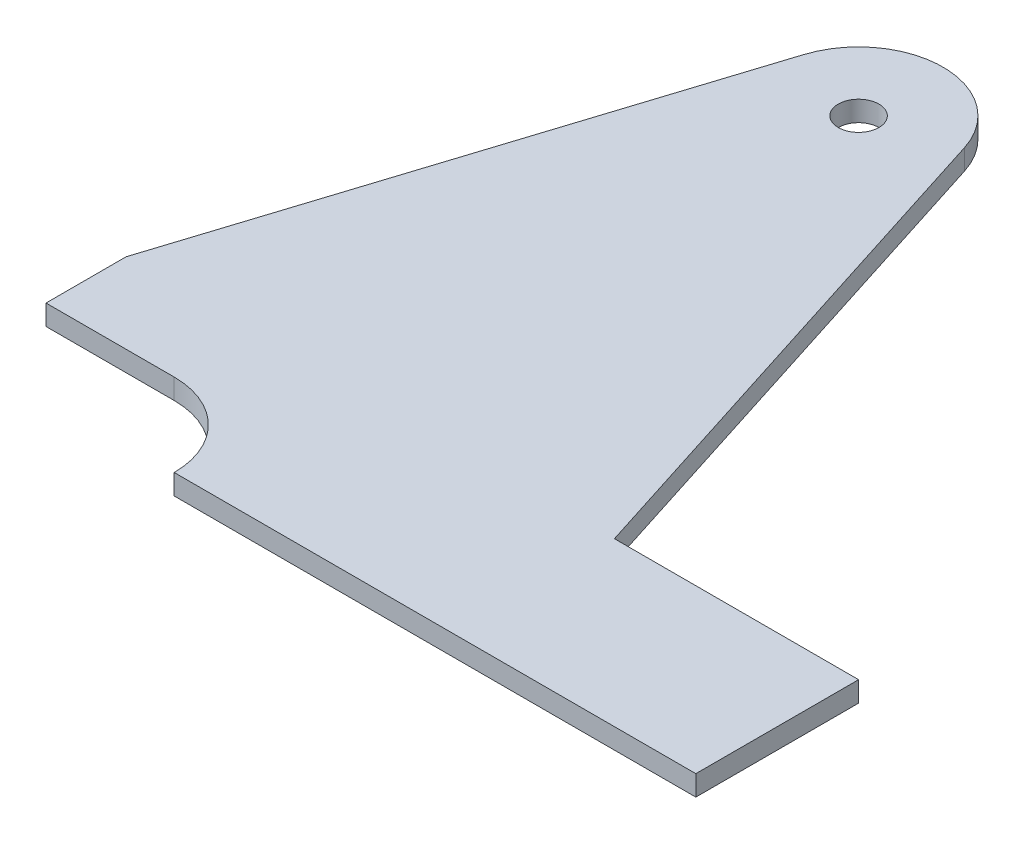
ISO-10303-21;
HEADER;
FILE_DESCRIPTION(('STEP AP214'),'2;1');
FILE_NAME('part.step','',(''),(''),'','','');
FILE_SCHEMA(('AUTOMOTIVE_DESIGN { 1 0 10303 214 1 1 1 1 }'));
ENDSEC;
DATA;
#1=APPLICATION_CONTEXT('core data for automotive mechanical design processes');
#2=APPLICATION_PROTOCOL_DEFINITION('international standard','automotive_design',2000,#1);
#3=PRODUCT_CONTEXT('',#1,'mechanical');
#4=PRODUCT('Part','Part','',(#3));
#5=PRODUCT_RELATED_PRODUCT_CATEGORY('part','',(#4));
#6=PRODUCT_DEFINITION_FORMATION('','',#4);
#7=PRODUCT_DEFINITION_CONTEXT('part definition',#1,'design');
#8=PRODUCT_DEFINITION('design','',#6,#7);
#9=PRODUCT_DEFINITION_SHAPE('','',#8);
#10=(LENGTH_UNIT() NAMED_UNIT(*) SI_UNIT(.MILLI.,.METRE.));
#11=(NAMED_UNIT(*) PLANE_ANGLE_UNIT() SI_UNIT($,.RADIAN.));
#12=(NAMED_UNIT(*) SI_UNIT($,.STERADIAN.) SOLID_ANGLE_UNIT());
#13=UNCERTAINTY_MEASURE_WITH_UNIT(LENGTH_MEASURE(1.E-05),#10,'distance_accuracy_value','');
#14=(GEOMETRIC_REPRESENTATION_CONTEXT(3) GLOBAL_UNCERTAINTY_ASSIGNED_CONTEXT((#13)) GLOBAL_UNIT_ASSIGNED_CONTEXT((#10,
#11,#12)) REPRESENTATION_CONTEXT('',''));
#15=CARTESIAN_POINT('',(0.,0.,0.));
#16=DIRECTION('',(0.,0.,1.));
#17=DIRECTION('',(1.,0.,0.));
#18=AXIS2_PLACEMENT_3D('',#15,#16,#17);
#19=CARTESIAN_POINT('',(-36.2,6.35,203.2));
#20=DIRECTION('',(0.,1.,0.));
#21=DIRECTION('',(0.,0.,1.));
#22=AXIS2_PLACEMENT_3D('',#19,#20,#21);
#23=PLANE('',#22);
#24=DIRECTION('',(0.,0.,1.));
#25=VECTOR('',#24,1.);
#26=CARTESIAN_POINT('',(-76.2,6.35,152.4));
#27=LINE('',#26,#25);
#28=CARTESIAN_POINT('',(-76.2,6.35,152.4));
#29=VERTEX_POINT('',#28);
#30=CARTESIAN_POINT('',(-76.2,6.35,177.4));
#31=VERTEX_POINT('',#30);
#32=EDGE_CURVE('E163',#29,#31,#27,.T.);
#33=ORIENTED_EDGE('',*,*,#32,.T.);
#34=DIRECTION('',(1.,0.,0.));
#35=VECTOR('',#34,1.);
#36=CARTESIAN_POINT('',(-76.2,6.35,177.4));
#37=LINE('',#36,#35);
#38=CARTESIAN_POINT('',(-36.2,6.35,177.4));
#39=VERTEX_POINT('',#38);
#40=EDGE_CURVE('E106',#31,#39,#37,.T.);
#41=ORIENTED_EDGE('',*,*,#40,.T.);
#42=CARTESIAN_POINT('',(-36.2,6.35,203.2));
#43=DIRECTION('',(0.,-1.,0.));
#44=DIRECTION('',(0.,0.,1.));
#45=AXIS2_PLACEMENT_3D('',#42,#43,#44);
#46=CIRCLE('',#45,25.8);
#47=CARTESIAN_POINT('',(-10.3999999999999,6.35,203.2));
#48=VERTEX_POINT('',#47);
#49=EDGE_CURVE('E181',#39,#48,#46,.T.);
#50=ORIENTED_EDGE('',*,*,#49,.T.);
#51=DIRECTION('',(1.,0.,0.));
#52=VECTOR('',#51,1.);
#53=CARTESIAN_POINT('',(152.4,6.35,203.2));
#54=LINE('',#53,#52);
#55=CARTESIAN_POINT('',(152.4,6.35,203.2));
#56=VERTEX_POINT('',#55);
#57=EDGE_CURVE('E198',#48,#56,#54,.T.);
#58=ORIENTED_EDGE('',*,*,#57,.T.);
#59=DIRECTION('',(0.,0.,-1.));
#60=VECTOR('',#59,1.);
#61=CARTESIAN_POINT('',(152.4,6.35,152.4));
#62=LINE('',#61,#60);
#63=CARTESIAN_POINT('',(152.4,6.35,152.4));
#64=VERTEX_POINT('',#63);
#65=EDGE_CURVE('E197',#56,#64,#62,.T.);
#66=ORIENTED_EDGE('',*,*,#65,.T.);
#67=DIRECTION('',(-1.,0.,0.));
#68=VECTOR('',#67,1.);
#69=CARTESIAN_POINT('',(76.2,6.35,152.4));
#70=LINE('',#69,#68);
#71=CARTESIAN_POINT('',(76.2,6.35,152.4));
#72=VERTEX_POINT('',#71);
#73=EDGE_CURVE('E128',#64,#72,#70,.T.);
#74=ORIENTED_EDGE('',*,*,#73,.T.);
#75=DIRECTION('',(-0.303513333205354,0.,-0.952827191345091));
#76=VECTOR('',#75,1.);
#77=CARTESIAN_POINT('',(76.2,6.35,152.4));
#78=LINE('',#77,#76);
#79=CARTESIAN_POINT('',(25.1069964919431,6.35,-7.99757632996109));
#80=VERTEX_POINT('',#79);
#81=EDGE_CURVE('E122',#72,#80,#78,.T.);
#82=ORIENTED_EDGE('',*,*,#81,.T.);
#83=CARTESIAN_POINT('',(0.,6.35,0.));
#84=DIRECTION('',(0.,1.,0.));
#85=DIRECTION('',(0.,0.,-1.));
#86=AXIS2_PLACEMENT_3D('',#83,#84,#85);
#87=CIRCLE('',#86,26.35);
#88=CARTESIAN_POINT('',(-25.1069964919431,6.35,-7.99757632996108));
#89=VERTEX_POINT('',#88);
#90=EDGE_CURVE('E126',#80,#89,#87,.T.);
#91=ORIENTED_EDGE('',*,*,#90,.T.);
#92=DIRECTION('',(-0.303513333205354,0.,0.952827191345091));
#93=VECTOR('',#92,1.);
#94=CARTESIAN_POINT('',(-76.2,6.35,152.4));
#95=LINE('',#94,#93);
#96=EDGE_CURVE('E60',#89,#29,#95,.T.);
#97=ORIENTED_EDGE('',*,*,#96,.T.);
#98=EDGE_LOOP('',(#33,#41,#50,#58,#66,#74,#82,#91,#97));
#99=FACE_BOUND('',#98,.T.);
#100=CARTESIAN_POINT('',(0.,6.35,0.));
#101=DIRECTION('',(0.,1.,0.));
#102=DIRECTION('',(0.,0.,1.));
#103=AXIS2_PLACEMENT_3D('',#100,#101,#102);
#104=CIRCLE('',#103,6.35);
#105=CARTESIAN_POINT('',(0.,6.35,6.35));
#106=VERTEX_POINT('',#105);
#107=EDGE_CURVE('E150',#106,#106,#104,.T.);
#108=ORIENTED_EDGE('',*,*,#107,.F.);
#109=EDGE_LOOP('',(#108));
#110=FACE_BOUND('',#109,.T.);
#111=ADVANCED_FACE('F43',(#99,#110),#23,.T.);
#112=CARTESIAN_POINT('',(-36.2,0.,203.2));
#113=DIRECTION('',(0.,1.,0.));
#114=DIRECTION('',(0.,0.,1.));
#115=AXIS2_PLACEMENT_3D('',#112,#113,#114);
#116=PLANE('',#115);
#117=DIRECTION('',(0.,0.,1.));
#118=VECTOR('',#117,1.);
#119=CARTESIAN_POINT('',(-76.2,0.,152.4));
#120=LINE('',#119,#118);
#121=CARTESIAN_POINT('',(-76.2,0.,152.4));
#122=VERTEX_POINT('',#121);
#123=CARTESIAN_POINT('',(-76.2,0.,177.4));
#124=VERTEX_POINT('',#123);
#125=EDGE_CURVE('E146',#122,#124,#120,.T.);
#126=ORIENTED_EDGE('',*,*,#125,.F.);
#127=DIRECTION('',(-0.303513333205354,0.,0.952827191345091));
#128=VECTOR('',#127,1.);
#129=CARTESIAN_POINT('',(-76.2,0.,152.4));
#130=LINE('',#129,#128);
#131=CARTESIAN_POINT('',(-25.1069964919431,0.,-7.99757632996108));
#132=VERTEX_POINT('',#131);
#133=EDGE_CURVE('E98',#132,#122,#130,.T.);
#134=ORIENTED_EDGE('',*,*,#133,.F.);
#135=CARTESIAN_POINT('',(0.,0.,0.));
#136=DIRECTION('',(0.,1.,0.));
#137=DIRECTION('',(0.,0.,-1.));
#138=AXIS2_PLACEMENT_3D('',#135,#136,#137);
#139=CIRCLE('',#138,26.35);
#140=CARTESIAN_POINT('',(25.1069964919431,0.,-7.99757632996109));
#141=VERTEX_POINT('',#140);
#142=EDGE_CURVE('E92',#141,#132,#139,.T.);
#143=ORIENTED_EDGE('',*,*,#142,.F.);
#144=DIRECTION('',(-0.303513333205354,0.,-0.952827191345091));
#145=VECTOR('',#144,1.);
#146=CARTESIAN_POINT('',(76.2,0.,152.4));
#147=LINE('',#146,#145);
#148=CARTESIAN_POINT('',(76.2,0.,152.4));
#149=VERTEX_POINT('',#148);
#150=EDGE_CURVE('E136',#149,#141,#147,.T.);
#151=ORIENTED_EDGE('',*,*,#150,.F.);
#152=DIRECTION('',(-1.,0.,0.));
#153=VECTOR('',#152,1.);
#154=CARTESIAN_POINT('',(76.2,0.,152.4));
#155=LINE('',#154,#153);
#156=CARTESIAN_POINT('',(152.4,0.,152.4));
#157=VERTEX_POINT('',#156);
#158=EDGE_CURVE('E158',#157,#149,#155,.T.);
#159=ORIENTED_EDGE('',*,*,#158,.F.);
#160=DIRECTION('',(0.,0.,-1.));
#161=VECTOR('',#160,1.);
#162=CARTESIAN_POINT('',(152.4,0.,152.4));
#163=LINE('',#162,#161);
#164=CARTESIAN_POINT('',(152.4,0.,203.2));
#165=VERTEX_POINT('',#164);
#166=EDGE_CURVE('E156',#165,#157,#163,.T.);
#167=ORIENTED_EDGE('',*,*,#166,.F.);
#168=DIRECTION('',(1.,0.,0.));
#169=VECTOR('',#168,1.);
#170=CARTESIAN_POINT('',(152.4,0.,203.2));
#171=LINE('',#170,#169);
#172=CARTESIAN_POINT('',(-10.3999999999999,0.,203.2));
#173=VERTEX_POINT('',#172);
#174=EDGE_CURVE('E154',#173,#165,#171,.T.);
#175=ORIENTED_EDGE('',*,*,#174,.F.);
#176=CARTESIAN_POINT('',(-36.2,0.,203.2));
#177=DIRECTION('',(0.,-1.,0.));
#178=DIRECTION('',(0.,0.,1.));
#179=AXIS2_PLACEMENT_3D('',#176,#177,#178);
#180=CIRCLE('',#179,25.8);
#181=CARTESIAN_POINT('',(-36.2,0.,177.4));
#182=VERTEX_POINT('',#181);
#183=EDGE_CURVE('E152',#182,#173,#180,.T.);
#184=ORIENTED_EDGE('',*,*,#183,.F.);
#185=DIRECTION('',(1.,0.,0.));
#186=VECTOR('',#185,1.);
#187=CARTESIAN_POINT('',(-76.2,0.,177.4));
#188=LINE('',#187,#186);
#189=EDGE_CURVE('E149',#124,#182,#188,.T.);
#190=ORIENTED_EDGE('',*,*,#189,.F.);
#191=EDGE_LOOP('',(#126,#134,#143,#151,#159,#167,#175,#184,#190));
#192=FACE_BOUND('',#191,.T.);
#193=CARTESIAN_POINT('',(0.,0.,0.));
#194=DIRECTION('',(0.,1.,0.));
#195=DIRECTION('',(0.,0.,1.));
#196=AXIS2_PLACEMENT_3D('',#193,#194,#195);
#197=CIRCLE('',#196,6.35);
#198=CARTESIAN_POINT('',(0.,0.,6.35));
#199=VERTEX_POINT('',#198);
#200=EDGE_CURVE('E205',#199,#199,#197,.T.);
#201=ORIENTED_EDGE('',*,*,#200,.T.);
#202=EDGE_LOOP('',(#201));
#203=FACE_BOUND('',#202,.T.);
#204=ADVANCED_FACE('F185',(#192,#203),#116,.F.);
#205=CARTESIAN_POINT('',(-76.2,6.35,152.4));
#206=DIRECTION('',(1.,0.,0.));
#207=DIRECTION('',(0.,0.,-1.));
#208=AXIS2_PLACEMENT_3D('',#205,#206,#207);
#209=PLANE('',#208);
#210=ORIENTED_EDGE('',*,*,#125,.T.);
#211=DIRECTION('',(0.,-1.,0.));
#212=VECTOR('',#211,1.);
#213=CARTESIAN_POINT('',(-76.2,6.35,177.4));
#214=LINE('',#213,#212);
#215=EDGE_CURVE('E11',#31,#124,#214,.T.);
#216=ORIENTED_EDGE('',*,*,#215,.F.);
#217=ORIENTED_EDGE('',*,*,#32,.F.);
#218=DIRECTION('',(0.,-1.,0.));
#219=VECTOR('',#218,1.);
#220=CARTESIAN_POINT('',(-76.2,6.35,152.4));
#221=LINE('',#220,#219);
#222=EDGE_CURVE('E142',#29,#122,#221,.T.);
#223=ORIENTED_EDGE('',*,*,#222,.T.);
#224=EDGE_LOOP('',(#210,#216,#217,#223));
#225=FACE_BOUND('',#224,.T.);
#226=ADVANCED_FACE('F45',(#225),#209,.F.);
#227=CARTESIAN_POINT('',(-76.2,6.35,177.4));
#228=DIRECTION('',(0.,0.,-1.));
#229=DIRECTION('',(-1.,0.,0.));
#230=AXIS2_PLACEMENT_3D('',#227,#228,#229);
#231=PLANE('',#230);
#232=ORIENTED_EDGE('',*,*,#189,.T.);
#233=DIRECTION('',(0.,-1.,0.));
#234=VECTOR('',#233,1.);
#235=CARTESIAN_POINT('',(-36.2,6.35,177.4));
#236=LINE('',#235,#234);
#237=EDGE_CURVE('E52',#39,#182,#236,.T.);
#238=ORIENTED_EDGE('',*,*,#237,.F.);
#239=ORIENTED_EDGE('',*,*,#40,.F.);
#240=ORIENTED_EDGE('',*,*,#215,.T.);
#241=EDGE_LOOP('',(#232,#238,#239,#240));
#242=FACE_BOUND('',#241,.T.);
#243=ADVANCED_FACE('F237',(#242),#231,.F.);
#244=CARTESIAN_POINT('',(-36.2,6.35,203.2));
#245=DIRECTION('',(0.,-1.,0.));
#246=DIRECTION('',(0.,0.,-1.));
#247=AXIS2_PLACEMENT_3D('',#244,#245,#246);
#248=CYLINDRICAL_SURFACE('',#247,25.8);
#249=ORIENTED_EDGE('',*,*,#183,.T.);
#250=DIRECTION('',(0.,-1.,0.));
#251=VECTOR('',#250,1.);
#252=CARTESIAN_POINT('',(-10.3999999999999,6.35,203.2));
#253=LINE('',#252,#251);
#254=EDGE_CURVE('E173',#48,#173,#253,.T.);
#255=ORIENTED_EDGE('',*,*,#254,.F.);
#256=ORIENTED_EDGE('',*,*,#49,.F.);
#257=ORIENTED_EDGE('',*,*,#237,.T.);
#258=EDGE_LOOP('',(#249,#255,#256,#257));
#259=FACE_BOUND('',#258,.T.);
#260=ADVANCED_FACE('F179',(#259),#248,.F.);
#261=CARTESIAN_POINT('',(152.4,6.35,203.2));
#262=DIRECTION('',(0.,0.,-1.));
#263=DIRECTION('',(-1.,0.,0.));
#264=AXIS2_PLACEMENT_3D('',#261,#262,#263);
#265=PLANE('',#264);
#266=ORIENTED_EDGE('',*,*,#174,.T.);
#267=DIRECTION('',(0.,-1.,0.));
#268=VECTOR('',#267,1.);
#269=CARTESIAN_POINT('',(152.4,6.35,203.2));
#270=LINE('',#269,#268);
#271=EDGE_CURVE('E170',#56,#165,#270,.T.);
#272=ORIENTED_EDGE('',*,*,#271,.F.);
#273=ORIENTED_EDGE('',*,*,#57,.F.);
#274=ORIENTED_EDGE('',*,*,#254,.T.);
#275=EDGE_LOOP('',(#266,#272,#273,#274));
#276=FACE_BOUND('',#275,.T.);
#277=ADVANCED_FACE('F191',(#276),#265,.F.);
#278=CARTESIAN_POINT('',(152.4,6.35,152.4));
#279=DIRECTION('',(-1.,0.,0.));
#280=DIRECTION('',(0.,0.,1.));
#281=AXIS2_PLACEMENT_3D('',#278,#279,#280);
#282=PLANE('',#281);
#283=ORIENTED_EDGE('',*,*,#166,.T.);
#284=DIRECTION('',(0.,-1.,0.));
#285=VECTOR('',#284,1.);
#286=CARTESIAN_POINT('',(152.4,6.35,152.4));
#287=LINE('',#286,#285);
#288=EDGE_CURVE('E167',#64,#157,#287,.T.);
#289=ORIENTED_EDGE('',*,*,#288,.F.);
#290=ORIENTED_EDGE('',*,*,#65,.F.);
#291=ORIENTED_EDGE('',*,*,#271,.T.);
#292=EDGE_LOOP('',(#283,#289,#290,#291));
#293=FACE_BOUND('',#292,.T.);
#294=ADVANCED_FACE('F195',(#293),#282,.F.);
#295=CARTESIAN_POINT('',(76.2,6.35,152.4));
#296=DIRECTION('',(0.,0.,1.));
#297=DIRECTION('',(1.,0.,0.));
#298=AXIS2_PLACEMENT_3D('',#295,#296,#297);
#299=PLANE('',#298);
#300=ORIENTED_EDGE('',*,*,#158,.T.);
#301=DIRECTION('',(0.,-1.,0.));
#302=VECTOR('',#301,1.);
#303=CARTESIAN_POINT('',(76.2,6.35,152.4));
#304=LINE('',#303,#302);
#305=EDGE_CURVE('E137',#72,#149,#304,.T.);
#306=ORIENTED_EDGE('',*,*,#305,.F.);
#307=ORIENTED_EDGE('',*,*,#73,.F.);
#308=ORIENTED_EDGE('',*,*,#288,.T.);
#309=EDGE_LOOP('',(#300,#306,#307,#308));
#310=FACE_BOUND('',#309,.T.);
#311=ADVANCED_FACE('F228',(#310),#299,.F.);
#312=CARTESIAN_POINT('',(76.2,6.35,152.4));
#313=DIRECTION('',(-0.952827191345091,0.,0.303513333205354));
#314=DIRECTION('',(0.303513333205354,0.,0.952827191345091));
#315=AXIS2_PLACEMENT_3D('',#312,#313,#314);
#316=PLANE('',#315);
#317=ORIENTED_EDGE('',*,*,#150,.T.);
#318=DIRECTION('',(0.,-1.,0.));
#319=VECTOR('',#318,1.);
#320=CARTESIAN_POINT('',(25.1069964919431,6.35,-7.99757632996109));
#321=LINE('',#320,#319);
#322=EDGE_CURVE('E133',#80,#141,#321,.T.);
#323=ORIENTED_EDGE('',*,*,#322,.F.);
#324=ORIENTED_EDGE('',*,*,#81,.F.);
#325=ORIENTED_EDGE('',*,*,#305,.T.);
#326=EDGE_LOOP('',(#317,#323,#324,#325));
#327=FACE_BOUND('',#326,.T.);
#328=ADVANCED_FACE('F134',(#327),#316,.F.);
#329=CARTESIAN_POINT('',(0.,6.35,0.));
#330=DIRECTION('',(0.,-1.,0.));
#331=DIRECTION('',(0.,0.,-1.));
#332=AXIS2_PLACEMENT_3D('',#329,#330,#331);
#333=CYLINDRICAL_SURFACE('',#332,26.35);
#334=ORIENTED_EDGE('',*,*,#142,.T.);
#335=DIRECTION('',(0.,-1.,0.));
#336=VECTOR('',#335,1.);
#337=CARTESIAN_POINT('',(-25.1069964919431,6.35,-7.99757632996108));
#338=LINE('',#337,#336);
#339=EDGE_CURVE('E138',#89,#132,#338,.T.);
#340=ORIENTED_EDGE('',*,*,#339,.F.);
#341=ORIENTED_EDGE('',*,*,#90,.F.);
#342=ORIENTED_EDGE('',*,*,#322,.T.);
#343=EDGE_LOOP('',(#334,#340,#341,#342));
#344=FACE_BOUND('',#343,.T.);
#345=ADVANCED_FACE('F140',(#344),#333,.T.);
#346=CARTESIAN_POINT('',(-76.2,6.35,152.4));
#347=DIRECTION('',(0.952827191345091,0.,0.303513333205354));
#348=DIRECTION('',(0.303513333205354,0.,-0.952827191345092));
#349=AXIS2_PLACEMENT_3D('',#346,#347,#348);
#350=PLANE('',#349);
#351=ORIENTED_EDGE('',*,*,#133,.T.);
#352=ORIENTED_EDGE('',*,*,#222,.F.);
#353=ORIENTED_EDGE('',*,*,#96,.F.);
#354=ORIENTED_EDGE('',*,*,#339,.T.);
#355=EDGE_LOOP('',(#351,#352,#353,#354));
#356=FACE_BOUND('',#355,.T.);
#357=ADVANCED_FACE('F221',(#356),#350,.F.);
#358=CARTESIAN_POINT('',(0.,6.35,0.));
#359=DIRECTION('',(0.,-1.,0.));
#360=DIRECTION('',(0.,0.,-1.));
#361=AXIS2_PLACEMENT_3D('',#358,#359,#360);
#362=CYLINDRICAL_SURFACE('',#361,6.35);
#363=ORIENTED_EDGE('',*,*,#107,.T.);
#364=EDGE_LOOP('',(#363));
#365=FACE_BOUND('',#364,.T.);
#366=ORIENTED_EDGE('',*,*,#200,.F.);
#367=EDGE_LOOP('',(#366));
#368=FACE_BOUND('',#367,.T.);
#369=ADVANCED_FACE('F211',(#365,#368),#362,.F.);
#370=CLOSED_SHELL('',(#111,#204,#226,#243,#260,#277,#294,#311,#328,#345,#357,#369));
#371=MANIFOLD_SOLID_BREP('B2',#370);
#372=ADVANCED_BREP_SHAPE_REPRESENTATION('',(#18,#371),#14);
#373=SHAPE_DEFINITION_REPRESENTATION(#9,#372);
ENDSEC;
END-ISO-10303-21;
